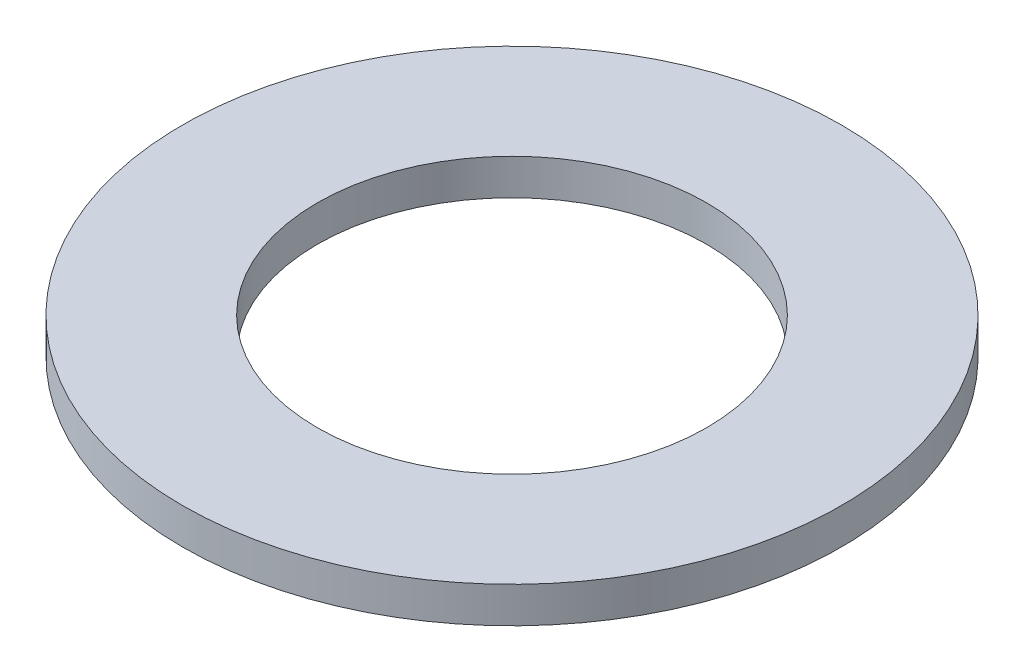
ISO-10303-21;
HEADER;
FILE_DESCRIPTION(('STEP AP214'),'2;1');
FILE_NAME('part.step','',(''),(''),'','','');
FILE_SCHEMA(('AUTOMOTIVE_DESIGN { 1 0 10303 214 1 1 1 1 }'));
ENDSEC;
DATA;
#1=APPLICATION_CONTEXT('core data for automotive mechanical design processes');
#2=APPLICATION_PROTOCOL_DEFINITION('international standard','automotive_design',2000,#1);
#3=PRODUCT_CONTEXT('',#1,'mechanical');
#4=PRODUCT('Part','Part','',(#3));
#5=PRODUCT_RELATED_PRODUCT_CATEGORY('part','',(#4));
#6=PRODUCT_DEFINITION_FORMATION('','',#4);
#7=PRODUCT_DEFINITION_CONTEXT('part definition',#1,'design');
#8=PRODUCT_DEFINITION('design','',#6,#7);
#9=PRODUCT_DEFINITION_SHAPE('','',#8);
#10=(LENGTH_UNIT() NAMED_UNIT(*) SI_UNIT(.MILLI.,.METRE.));
#11=(NAMED_UNIT(*) PLANE_ANGLE_UNIT() SI_UNIT($,.RADIAN.));
#12=(NAMED_UNIT(*) SI_UNIT($,.STERADIAN.) SOLID_ANGLE_UNIT());
#13=UNCERTAINTY_MEASURE_WITH_UNIT(LENGTH_MEASURE(1.E-05),#10,'distance_accuracy_value','');
#14=(GEOMETRIC_REPRESENTATION_CONTEXT(3) GLOBAL_UNCERTAINTY_ASSIGNED_CONTEXT((#13)) GLOBAL_UNIT_ASSIGNED_CONTEXT((#10,
#11,#12)) REPRESENTATION_CONTEXT('',''));
#15=CARTESIAN_POINT('',(0.,0.,0.));
#16=DIRECTION('',(0.,0.,1.));
#17=DIRECTION('',(1.,0.,0.));
#18=AXIS2_PLACEMENT_3D('',#15,#16,#17);
#19=CARTESIAN_POINT('',(0.,6.,0.));
#20=DIRECTION('',(0.,-1.,0.));
#21=DIRECTION('',(0.,0.,-1.));
#22=AXIS2_PLACEMENT_3D('',#19,#20,#21);
#23=CYLINDRICAL_SURFACE('',#22,55.);
#24=CARTESIAN_POINT('',(0.,6.,0.));
#25=DIRECTION('',(0.,1.,0.));
#26=DIRECTION('',(0.,0.,1.));
#27=AXIS2_PLACEMENT_3D('',#24,#25,#26);
#28=CIRCLE('',#27,55.);
#29=CARTESIAN_POINT('',(0.,6.,55.));
#30=VERTEX_POINT('',#29);
#31=EDGE_CURVE('E10',#30,#30,#28,.T.);
#32=ORIENTED_EDGE('',*,*,#31,.F.);
#33=EDGE_LOOP('',(#32));
#34=FACE_BOUND('',#33,.T.);
#35=CARTESIAN_POINT('',(0.,0.,0.));
#36=DIRECTION('',(0.,1.,0.));
#37=DIRECTION('',(0.,0.,1.));
#38=AXIS2_PLACEMENT_3D('',#35,#36,#37);
#39=CIRCLE('',#38,55.);
#40=CARTESIAN_POINT('',(0.,0.,55.));
#41=VERTEX_POINT('',#40);
#42=EDGE_CURVE('E37',#41,#41,#39,.T.);
#43=ORIENTED_EDGE('',*,*,#42,.T.);
#44=EDGE_LOOP('',(#43));
#45=FACE_BOUND('',#44,.T.);
#46=ADVANCED_FACE('F40',(#34,#45),#23,.T.);
#47=CARTESIAN_POINT('',(0.,6.,0.));
#48=DIRECTION('',(0.,1.,0.));
#49=DIRECTION('',(0.,0.,1.));
#50=AXIS2_PLACEMENT_3D('',#47,#48,#49);
#51=PLANE('',#50);
#52=CARTESIAN_POINT('',(0.,6.,0.));
#53=DIRECTION('',(0.,1.,0.));
#54=DIRECTION('',(0.,0.,1.));
#55=AXIS2_PLACEMENT_3D('',#52,#53,#54);
#56=CIRCLE('',#55,32.5);
#57=CARTESIAN_POINT('',(0.,6.,32.5));
#58=VERTEX_POINT('',#57);
#59=EDGE_CURVE('E50',#58,#58,#56,.T.);
#60=ORIENTED_EDGE('',*,*,#59,.F.);
#61=EDGE_LOOP('',(#60));
#62=FACE_BOUND('',#61,.T.);
#63=ORIENTED_EDGE('',*,*,#31,.T.);
#64=EDGE_LOOP('',(#63));
#65=FACE_BOUND('',#64,.T.);
#66=ADVANCED_FACE('F59',(#62,#65),#51,.T.);
#67=CARTESIAN_POINT('',(0.,0.,0.));
#68=DIRECTION('',(0.,1.,0.));
#69=DIRECTION('',(0.,0.,1.));
#70=AXIS2_PLACEMENT_3D('',#67,#68,#69);
#71=PLANE('',#70);
#72=CARTESIAN_POINT('',(0.,0.,0.));
#73=DIRECTION('',(0.,1.,0.));
#74=DIRECTION('',(0.,0.,1.));
#75=AXIS2_PLACEMENT_3D('',#72,#73,#74);
#76=CIRCLE('',#75,32.5);
#77=CARTESIAN_POINT('',(0.,0.,32.5));
#78=VERTEX_POINT('',#77);
#79=EDGE_CURVE('E47',#78,#78,#76,.T.);
#80=ORIENTED_EDGE('',*,*,#79,.T.);
#81=EDGE_LOOP('',(#80));
#82=FACE_BOUND('',#81,.T.);
#83=ORIENTED_EDGE('',*,*,#42,.F.);
#84=EDGE_LOOP('',(#83));
#85=FACE_BOUND('',#84,.T.);
#86=ADVANCED_FACE('F58',(#82,#85),#71,.F.);
#87=CARTESIAN_POINT('',(0.,6.,0.));
#88=DIRECTION('',(0.,-1.,0.));
#89=DIRECTION('',(0.,0.,-1.));
#90=AXIS2_PLACEMENT_3D('',#87,#88,#89);
#91=CYLINDRICAL_SURFACE('',#90,32.5);
#92=ORIENTED_EDGE('',*,*,#59,.T.);
#93=EDGE_LOOP('',(#92));
#94=FACE_BOUND('',#93,.T.);
#95=ORIENTED_EDGE('',*,*,#79,.F.);
#96=EDGE_LOOP('',(#95));
#97=FACE_BOUND('',#96,.T.);
#98=ADVANCED_FACE('F54',(#94,#97),#91,.F.);
#99=CLOSED_SHELL('',(#46,#66,#86,#98));
#100=MANIFOLD_SOLID_BREP('B2',#99);
#101=ADVANCED_BREP_SHAPE_REPRESENTATION('',(#18,#100),#14);
#102=SHAPE_DEFINITION_REPRESENTATION(#9,#101);
ENDSEC;
END-ISO-10303-21;
